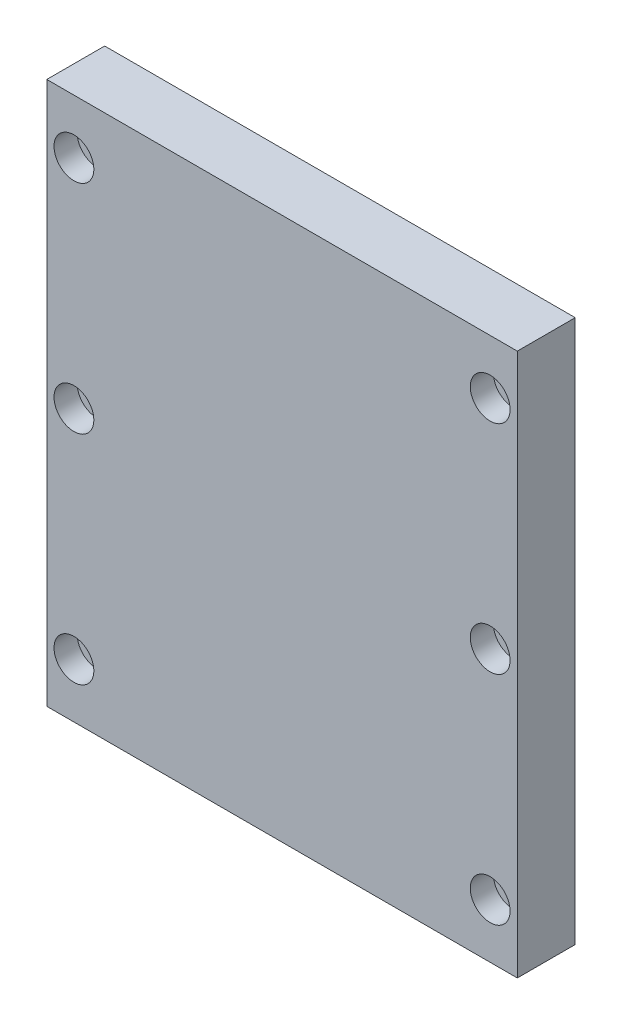
ISO-10303-21;
HEADER;
FILE_DESCRIPTION(('STEP AP214'),'2;1');
FILE_NAME('part.step','',(''),(''),'','','');
FILE_SCHEMA(('AUTOMOTIVE_DESIGN { 1 0 10303 214 1 1 1 1 }'));
ENDSEC;
DATA;
#1=APPLICATION_CONTEXT('core data for automotive mechanical design processes');
#2=APPLICATION_PROTOCOL_DEFINITION('international standard','automotive_design',2000,#1);
#3=PRODUCT_CONTEXT('',#1,'mechanical');
#4=PRODUCT('Part','Part','',(#3));
#5=PRODUCT_RELATED_PRODUCT_CATEGORY('part','',(#4));
#6=PRODUCT_DEFINITION_FORMATION('','',#4);
#7=PRODUCT_DEFINITION_CONTEXT('part definition',#1,'design');
#8=PRODUCT_DEFINITION('design','',#6,#7);
#9=PRODUCT_DEFINITION_SHAPE('','',#8);
#10=(LENGTH_UNIT() NAMED_UNIT(*) SI_UNIT(.MILLI.,.METRE.));
#11=(NAMED_UNIT(*) PLANE_ANGLE_UNIT() SI_UNIT($,.RADIAN.));
#12=(NAMED_UNIT(*) SI_UNIT($,.STERADIAN.) SOLID_ANGLE_UNIT());
#13=UNCERTAINTY_MEASURE_WITH_UNIT(LENGTH_MEASURE(1.E-05),#10,'distance_accuracy_value','');
#14=(GEOMETRIC_REPRESENTATION_CONTEXT(3) GLOBAL_UNCERTAINTY_ASSIGNED_CONTEXT((#13)) GLOBAL_UNIT_ASSIGNED_CONTEXT((#10,
#11,#12)) REPRESENTATION_CONTEXT('',''));
#15=CARTESIAN_POINT('',(0.,0.,0.));
#16=DIRECTION('',(0.,0.,1.));
#17=DIRECTION('',(1.,0.,0.));
#18=AXIS2_PLACEMENT_3D('',#15,#16,#17);
#19=CARTESIAN_POINT('',(65.,75.,16.));
#20=DIRECTION('',(-1.,0.,0.));
#21=DIRECTION('',(0.,-1.,0.));
#22=AXIS2_PLACEMENT_3D('',#19,#20,#21);
#23=PLANE('',#22);
#24=DIRECTION('',(0.,1.,0.));
#25=VECTOR('',#24,1.);
#26=CARTESIAN_POINT('',(65.,75.,0.));
#27=LINE('',#26,#25);
#28=CARTESIAN_POINT('',(65.,-75.,0.));
#29=VERTEX_POINT('',#28);
#30=CARTESIAN_POINT('',(65.,75.,0.));
#31=VERTEX_POINT('',#30);
#32=EDGE_CURVE('E98',#29,#31,#27,.T.);
#33=ORIENTED_EDGE('',*,*,#32,.T.);
#34=DIRECTION('',(0.,0.,-1.));
#35=VECTOR('',#34,1.);
#36=CARTESIAN_POINT('',(65.,75.,16.));
#37=LINE('',#36,#35);
#38=CARTESIAN_POINT('',(65.,75.,16.));
#39=VERTEX_POINT('',#38);
#40=EDGE_CURVE('E11',#39,#31,#37,.T.);
#41=ORIENTED_EDGE('',*,*,#40,.F.);
#42=DIRECTION('',(0.,1.,0.));
#43=VECTOR('',#42,1.);
#44=CARTESIAN_POINT('',(65.,75.,16.));
#45=LINE('',#44,#43);
#46=CARTESIAN_POINT('',(65.,-75.,16.));
#47=VERTEX_POINT('',#46);
#48=EDGE_CURVE('E86',#47,#39,#45,.T.);
#49=ORIENTED_EDGE('',*,*,#48,.F.);
#50=DIRECTION('',(0.,0.,-1.));
#51=VECTOR('',#50,1.);
#52=CARTESIAN_POINT('',(65.,-75.,16.));
#53=LINE('',#52,#51);
#54=EDGE_CURVE('E94',#47,#29,#53,.T.);
#55=ORIENTED_EDGE('',*,*,#54,.T.);
#56=EDGE_LOOP('',(#33,#41,#49,#55));
#57=FACE_BOUND('',#56,.T.);
#58=ADVANCED_FACE('F35',(#57),#23,.F.);
#59=CARTESIAN_POINT('',(-65.,75.,16.));
#60=DIRECTION('',(0.,-1.,0.));
#61=DIRECTION('',(0.,0.,-1.));
#62=AXIS2_PLACEMENT_3D('',#59,#60,#61);
#63=PLANE('',#62);
#64=DIRECTION('',(-1.,0.,0.));
#65=VECTOR('',#64,1.);
#66=CARTESIAN_POINT('',(-65.,75.,0.));
#67=LINE('',#66,#65);
#68=CARTESIAN_POINT('',(-65.,75.,0.));
#69=VERTEX_POINT('',#68);
#70=EDGE_CURVE('E90',#31,#69,#67,.T.);
#71=ORIENTED_EDGE('',*,*,#70,.T.);
#72=DIRECTION('',(0.,0.,-1.));
#73=VECTOR('',#72,1.);
#74=CARTESIAN_POINT('',(-65.,75.,16.));
#75=LINE('',#74,#73);
#76=CARTESIAN_POINT('',(-65.,75.,16.));
#77=VERTEX_POINT('',#76);
#78=EDGE_CURVE('E43',#77,#69,#75,.T.);
#79=ORIENTED_EDGE('',*,*,#78,.F.);
#80=DIRECTION('',(-1.,0.,0.));
#81=VECTOR('',#80,1.);
#82=CARTESIAN_POINT('',(-65.,75.,16.));
#83=LINE('',#82,#81);
#84=EDGE_CURVE('E81',#39,#77,#83,.T.);
#85=ORIENTED_EDGE('',*,*,#84,.F.);
#86=ORIENTED_EDGE('',*,*,#40,.T.);
#87=EDGE_LOOP('',(#71,#79,#85,#86));
#88=FACE_BOUND('',#87,.T.);
#89=ADVANCED_FACE('F89',(#88),#63,.F.);
#90=CARTESIAN_POINT('',(-65.,75.,16.));
#91=DIRECTION('',(1.,0.,0.));
#92=DIRECTION('',(0.,1.,0.));
#93=AXIS2_PLACEMENT_3D('',#90,#91,#92);
#94=PLANE('',#93);
#95=DIRECTION('',(0.,-1.,0.));
#96=VECTOR('',#95,1.);
#97=CARTESIAN_POINT('',(-65.,75.,0.));
#98=LINE('',#97,#96);
#99=CARTESIAN_POINT('',(-65.,-75.,0.));
#100=VERTEX_POINT('',#99);
#101=EDGE_CURVE('E68',#69,#100,#98,.T.);
#102=ORIENTED_EDGE('',*,*,#101,.T.);
#103=DIRECTION('',(0.,0.,-1.));
#104=VECTOR('',#103,1.);
#105=CARTESIAN_POINT('',(-65.,-75.,16.));
#106=LINE('',#105,#104);
#107=CARTESIAN_POINT('',(-65.,-75.,16.));
#108=VERTEX_POINT('',#107);
#109=EDGE_CURVE('E91',#108,#100,#106,.T.);
#110=ORIENTED_EDGE('',*,*,#109,.F.);
#111=DIRECTION('',(0.,-1.,0.));
#112=VECTOR('',#111,1.);
#113=CARTESIAN_POINT('',(-65.,75.,16.));
#114=LINE('',#113,#112);
#115=EDGE_CURVE('E84',#77,#108,#114,.T.);
#116=ORIENTED_EDGE('',*,*,#115,.F.);
#117=ORIENTED_EDGE('',*,*,#78,.T.);
#118=EDGE_LOOP('',(#102,#110,#116,#117));
#119=FACE_BOUND('',#118,.T.);
#120=ADVANCED_FACE('F92',(#119),#94,.F.);
#121=CARTESIAN_POINT('',(-65.,-75.,16.));
#122=DIRECTION('',(0.,1.,0.));
#123=DIRECTION('',(0.,0.,1.));
#124=AXIS2_PLACEMENT_3D('',#121,#122,#123);
#125=PLANE('',#124);
#126=DIRECTION('',(1.,0.,0.));
#127=VECTOR('',#126,1.);
#128=CARTESIAN_POINT('',(-65.,-75.,0.));
#129=LINE('',#128,#127);
#130=EDGE_CURVE('E74',#100,#29,#129,.T.);
#131=ORIENTED_EDGE('',*,*,#130,.T.);
#132=ORIENTED_EDGE('',*,*,#54,.F.);
#133=DIRECTION('',(1.,0.,0.));
#134=VECTOR('',#133,1.);
#135=CARTESIAN_POINT('',(-65.,-75.,16.));
#136=LINE('',#135,#134);
#137=EDGE_CURVE('E51',#108,#47,#136,.T.);
#138=ORIENTED_EDGE('',*,*,#137,.F.);
#139=ORIENTED_EDGE('',*,*,#109,.T.);
#140=EDGE_LOOP('',(#131,#132,#138,#139));
#141=FACE_BOUND('',#140,.T.);
#142=ADVANCED_FACE('F106',(#141),#125,.F.);
#143=CARTESIAN_POINT('',(0.,0.,16.));
#144=DIRECTION('',(0.,0.,1.));
#145=DIRECTION('',(1.,0.,0.));
#146=AXIS2_PLACEMENT_3D('',#143,#144,#145);
#147=PLANE('',#146);
#148=CARTESIAN_POINT('',(-57.5,60.,16.));
#149=DIRECTION('',(0.,0.,1.));
#150=DIRECTION('',(1.,0.,0.));
#151=AXIS2_PLACEMENT_3D('',#148,#149,#150);
#152=CIRCLE('',#151,5.5);
#153=CARTESIAN_POINT('',(-52.,60.,16.));
#154=VERTEX_POINT('',#153);
#155=EDGE_CURVE('E180',#154,#154,#152,.T.);
#156=ORIENTED_EDGE('',*,*,#155,.F.);
#157=EDGE_LOOP('',(#156));
#158=FACE_BOUND('',#157,.T.);
#159=CARTESIAN_POINT('',(-57.5,0.,16.));
#160=DIRECTION('',(0.,0.,1.));
#161=DIRECTION('',(1.,0.,0.));
#162=AXIS2_PLACEMENT_3D('',#159,#160,#161);
#163=CIRCLE('',#162,5.5);
#164=CARTESIAN_POINT('',(-52.,0.,16.));
#165=VERTEX_POINT('',#164);
#166=EDGE_CURVE('E168',#165,#165,#163,.T.);
#167=ORIENTED_EDGE('',*,*,#166,.F.);
#168=EDGE_LOOP('',(#167));
#169=FACE_BOUND('',#168,.T.);
#170=CARTESIAN_POINT('',(-57.5,-60.,16.));
#171=DIRECTION('',(0.,0.,1.));
#172=DIRECTION('',(1.,0.,0.));
#173=AXIS2_PLACEMENT_3D('',#170,#171,#172);
#174=CIRCLE('',#173,5.5);
#175=CARTESIAN_POINT('',(-52.,-60.,16.));
#176=VERTEX_POINT('',#175);
#177=EDGE_CURVE('E156',#176,#176,#174,.T.);
#178=ORIENTED_EDGE('',*,*,#177,.F.);
#179=EDGE_LOOP('',(#178));
#180=FACE_BOUND('',#179,.T.);
#181=CARTESIAN_POINT('',(57.5,-60.,16.));
#182=DIRECTION('',(0.,0.,1.));
#183=DIRECTION('',(1.,0.,0.));
#184=AXIS2_PLACEMENT_3D('',#181,#182,#183);
#185=CIRCLE('',#184,5.5);
#186=CARTESIAN_POINT('',(63.,-60.,16.));
#187=VERTEX_POINT('',#186);
#188=EDGE_CURVE('E144',#187,#187,#185,.T.);
#189=ORIENTED_EDGE('',*,*,#188,.F.);
#190=EDGE_LOOP('',(#189));
#191=FACE_BOUND('',#190,.T.);
#192=CARTESIAN_POINT('',(57.5,0.,16.));
#193=DIRECTION('',(0.,0.,1.));
#194=DIRECTION('',(1.,0.,0.));
#195=AXIS2_PLACEMENT_3D('',#192,#193,#194);
#196=CIRCLE('',#195,5.5);
#197=CARTESIAN_POINT('',(63.,0.,16.));
#198=VERTEX_POINT('',#197);
#199=EDGE_CURVE('E132',#198,#198,#196,.T.);
#200=ORIENTED_EDGE('',*,*,#199,.F.);
#201=EDGE_LOOP('',(#200));
#202=FACE_BOUND('',#201,.T.);
#203=CARTESIAN_POINT('',(57.5,60.,16.));
#204=DIRECTION('',(0.,0.,1.));
#205=DIRECTION('',(1.,0.,0.));
#206=AXIS2_PLACEMENT_3D('',#203,#204,#205);
#207=CIRCLE('',#206,5.5);
#208=CARTESIAN_POINT('',(63.,60.,16.));
#209=VERTEX_POINT('',#208);
#210=EDGE_CURVE('E120',#209,#209,#207,.T.);
#211=ORIENTED_EDGE('',*,*,#210,.F.);
#212=EDGE_LOOP('',(#211));
#213=FACE_BOUND('',#212,.T.);
#214=ORIENTED_EDGE('',*,*,#48,.T.);
#215=ORIENTED_EDGE('',*,*,#84,.T.);
#216=ORIENTED_EDGE('',*,*,#115,.T.);
#217=ORIENTED_EDGE('',*,*,#137,.T.);
#218=EDGE_LOOP('',(#214,#215,#216,#217));
#219=FACE_BOUND('',#218,.T.);
#220=ADVANCED_FACE('F82',(#158,#169,#180,#191,#202,#213,#219),#147,.T.);
#221=CARTESIAN_POINT('',(0.,0.,0.));
#222=DIRECTION('',(0.,0.,1.));
#223=DIRECTION('',(1.,0.,0.));
#224=AXIS2_PLACEMENT_3D('',#221,#222,#223);
#225=PLANE('',#224);
#226=CARTESIAN_POINT('',(-57.5,60.,0.));
#227=DIRECTION('',(0.,0.,1.));
#228=DIRECTION('',(1.,0.,0.));
#229=AXIS2_PLACEMENT_3D('',#226,#227,#228);
#230=CIRCLE('',#229,3.3);
#231=CARTESIAN_POINT('',(-54.2,60.,0.));
#232=VERTEX_POINT('',#231);
#233=EDGE_CURVE('E171',#232,#232,#230,.T.);
#234=ORIENTED_EDGE('',*,*,#233,.T.);
#235=EDGE_LOOP('',(#234));
#236=FACE_BOUND('',#235,.T.);
#237=CARTESIAN_POINT('',(-57.5,0.,0.));
#238=DIRECTION('',(0.,0.,1.));
#239=DIRECTION('',(1.,0.,0.));
#240=AXIS2_PLACEMENT_3D('',#237,#238,#239);
#241=CIRCLE('',#240,3.3);
#242=CARTESIAN_POINT('',(-54.2,0.,0.));
#243=VERTEX_POINT('',#242);
#244=EDGE_CURVE('E159',#243,#243,#241,.T.);
#245=ORIENTED_EDGE('',*,*,#244,.T.);
#246=EDGE_LOOP('',(#245));
#247=FACE_BOUND('',#246,.T.);
#248=CARTESIAN_POINT('',(-57.5,-60.,0.));
#249=DIRECTION('',(0.,0.,1.));
#250=DIRECTION('',(1.,0.,0.));
#251=AXIS2_PLACEMENT_3D('',#248,#249,#250);
#252=CIRCLE('',#251,3.3);
#253=CARTESIAN_POINT('',(-54.2,-60.,0.));
#254=VERTEX_POINT('',#253);
#255=EDGE_CURVE('E147',#254,#254,#252,.T.);
#256=ORIENTED_EDGE('',*,*,#255,.T.);
#257=EDGE_LOOP('',(#256));
#258=FACE_BOUND('',#257,.T.);
#259=CARTESIAN_POINT('',(57.5,-60.,0.));
#260=DIRECTION('',(0.,0.,1.));
#261=DIRECTION('',(1.,0.,0.));
#262=AXIS2_PLACEMENT_3D('',#259,#260,#261);
#263=CIRCLE('',#262,3.3);
#264=CARTESIAN_POINT('',(60.8,-60.,0.));
#265=VERTEX_POINT('',#264);
#266=EDGE_CURVE('E135',#265,#265,#263,.T.);
#267=ORIENTED_EDGE('',*,*,#266,.T.);
#268=EDGE_LOOP('',(#267));
#269=FACE_BOUND('',#268,.T.);
#270=CARTESIAN_POINT('',(57.5,0.,0.));
#271=DIRECTION('',(0.,0.,1.));
#272=DIRECTION('',(1.,0.,0.));
#273=AXIS2_PLACEMENT_3D('',#270,#271,#272);
#274=CIRCLE('',#273,3.3);
#275=CARTESIAN_POINT('',(60.8,0.,0.));
#276=VERTEX_POINT('',#275);
#277=EDGE_CURVE('E123',#276,#276,#274,.T.);
#278=ORIENTED_EDGE('',*,*,#277,.T.);
#279=EDGE_LOOP('',(#278));
#280=FACE_BOUND('',#279,.T.);
#281=CARTESIAN_POINT('',(57.5,60.,0.));
#282=DIRECTION('',(0.,0.,1.));
#283=DIRECTION('',(1.,0.,0.));
#284=AXIS2_PLACEMENT_3D('',#281,#282,#283);
#285=CIRCLE('',#284,3.3);
#286=CARTESIAN_POINT('',(60.8,60.,0.));
#287=VERTEX_POINT('',#286);
#288=EDGE_CURVE('E101',#287,#287,#285,.T.);
#289=ORIENTED_EDGE('',*,*,#288,.T.);
#290=EDGE_LOOP('',(#289));
#291=FACE_BOUND('',#290,.T.);
#292=ORIENTED_EDGE('',*,*,#32,.F.);
#293=ORIENTED_EDGE('',*,*,#130,.F.);
#294=ORIENTED_EDGE('',*,*,#101,.F.);
#295=ORIENTED_EDGE('',*,*,#70,.F.);
#296=EDGE_LOOP('',(#292,#293,#294,#295));
#297=FACE_BOUND('',#296,.T.);
#298=ADVANCED_FACE('F109',(#236,#247,#258,#269,#280,#291,#297),#225,.F.);
#299=CARTESIAN_POINT('',(57.5,60.,16.));
#300=DIRECTION('',(0.,0.,1.));
#301=DIRECTION('',(1.,0.,0.));
#302=AXIS2_PLACEMENT_3D('',#299,#300,#301);
#303=CYLINDRICAL_SURFACE('',#302,3.3);
#304=ORIENTED_EDGE('',*,*,#288,.F.);
#305=EDGE_LOOP('',(#304));
#306=FACE_BOUND('',#305,.T.);
#307=CARTESIAN_POINT('',(57.5,60.,9.6));
#308=DIRECTION('',(0.,0.,1.));
#309=DIRECTION('',(1.,0.,0.));
#310=AXIS2_PLACEMENT_3D('',#307,#308,#309);
#311=CIRCLE('',#310,3.3);
#312=CARTESIAN_POINT('',(60.8,60.,9.6));
#313=VERTEX_POINT('',#312);
#314=EDGE_CURVE('E114',#313,#313,#311,.T.);
#315=ORIENTED_EDGE('',*,*,#314,.T.);
#316=EDGE_LOOP('',(#315));
#317=FACE_BOUND('',#316,.T.);
#318=ADVANCED_FACE('F212',(#306,#317),#303,.F.);
#319=CARTESIAN_POINT('',(60.8,60.,9.6));
#320=DIRECTION('',(0.,0.,-1.));
#321=DIRECTION('',(-1.,0.,0.));
#322=AXIS2_PLACEMENT_3D('',#319,#320,#321);
#323=PLANE('',#322);
#324=ORIENTED_EDGE('',*,*,#314,.F.);
#325=EDGE_LOOP('',(#324));
#326=FACE_BOUND('',#325,.T.);
#327=CARTESIAN_POINT('',(57.5,60.,9.6));
#328=DIRECTION('',(0.,0.,1.));
#329=DIRECTION('',(1.,0.,0.));
#330=AXIS2_PLACEMENT_3D('',#327,#328,#329);
#331=CIRCLE('',#330,5.5);
#332=CARTESIAN_POINT('',(63.,60.,9.6));
#333=VERTEX_POINT('',#332);
#334=EDGE_CURVE('E117',#333,#333,#331,.T.);
#335=ORIENTED_EDGE('',*,*,#334,.T.);
#336=EDGE_LOOP('',(#335));
#337=FACE_BOUND('',#336,.T.);
#338=ADVANCED_FACE('F202',(#326,#337),#323,.F.);
#339=CARTESIAN_POINT('',(57.5,60.,16.));
#340=DIRECTION('',(0.,0.,1.));
#341=DIRECTION('',(1.,0.,0.));
#342=AXIS2_PLACEMENT_3D('',#339,#340,#341);
#343=CYLINDRICAL_SURFACE('',#342,5.5);
#344=ORIENTED_EDGE('',*,*,#334,.F.);
#345=EDGE_LOOP('',(#344));
#346=FACE_BOUND('',#345,.T.);
#347=ORIENTED_EDGE('',*,*,#210,.T.);
#348=EDGE_LOOP('',(#347));
#349=FACE_BOUND('',#348,.T.);
#350=ADVANCED_FACE('F199',(#346,#349),#343,.F.);
#351=CARTESIAN_POINT('',(57.5,0.,16.));
#352=DIRECTION('',(0.,0.,1.));
#353=DIRECTION('',(1.,0.,0.));
#354=AXIS2_PLACEMENT_3D('',#351,#352,#353);
#355=CYLINDRICAL_SURFACE('',#354,3.3);
#356=ORIENTED_EDGE('',*,*,#277,.F.);
#357=EDGE_LOOP('',(#356));
#358=FACE_BOUND('',#357,.T.);
#359=CARTESIAN_POINT('',(57.5,0.,9.6));
#360=DIRECTION('',(0.,0.,1.));
#361=DIRECTION('',(1.,0.,0.));
#362=AXIS2_PLACEMENT_3D('',#359,#360,#361);
#363=CIRCLE('',#362,3.3);
#364=CARTESIAN_POINT('',(60.8,0.,9.6));
#365=VERTEX_POINT('',#364);
#366=EDGE_CURVE('E126',#365,#365,#363,.T.);
#367=ORIENTED_EDGE('',*,*,#366,.T.);
#368=EDGE_LOOP('',(#367));
#369=FACE_BOUND('',#368,.T.);
#370=ADVANCED_FACE('F201',(#358,#369),#355,.F.);
#371=CARTESIAN_POINT('',(60.8,0.,9.6));
#372=DIRECTION('',(0.,0.,-1.));
#373=DIRECTION('',(-1.,0.,0.));
#374=AXIS2_PLACEMENT_3D('',#371,#372,#373);
#375=PLANE('',#374);
#376=ORIENTED_EDGE('',*,*,#366,.F.);
#377=EDGE_LOOP('',(#376));
#378=FACE_BOUND('',#377,.T.);
#379=CARTESIAN_POINT('',(57.5,0.,9.6));
#380=DIRECTION('',(0.,0.,1.));
#381=DIRECTION('',(1.,0.,0.));
#382=AXIS2_PLACEMENT_3D('',#379,#380,#381);
#383=CIRCLE('',#382,5.5);
#384=CARTESIAN_POINT('',(63.,0.,9.6));
#385=VERTEX_POINT('',#384);
#386=EDGE_CURVE('E129',#385,#385,#383,.T.);
#387=ORIENTED_EDGE('',*,*,#386,.T.);
#388=EDGE_LOOP('',(#387));
#389=FACE_BOUND('',#388,.T.);
#390=ADVANCED_FACE('F209',(#378,#389),#375,.F.);
#391=CARTESIAN_POINT('',(57.5,0.,16.));
#392=DIRECTION('',(0.,0.,1.));
#393=DIRECTION('',(1.,0.,0.));
#394=AXIS2_PLACEMENT_3D('',#391,#392,#393);
#395=CYLINDRICAL_SURFACE('',#394,5.5);
#396=ORIENTED_EDGE('',*,*,#386,.F.);
#397=EDGE_LOOP('',(#396));
#398=FACE_BOUND('',#397,.T.);
#399=ORIENTED_EDGE('',*,*,#199,.T.);
#400=EDGE_LOOP('',(#399));
#401=FACE_BOUND('',#400,.T.);
#402=ADVANCED_FACE('F264',(#398,#401),#395,.F.);
#403=CARTESIAN_POINT('',(57.5,-60.,16.));
#404=DIRECTION('',(0.,0.,1.));
#405=DIRECTION('',(1.,0.,0.));
#406=AXIS2_PLACEMENT_3D('',#403,#404,#405);
#407=CYLINDRICAL_SURFACE('',#406,3.3);
#408=ORIENTED_EDGE('',*,*,#266,.F.);
#409=EDGE_LOOP('',(#408));
#410=FACE_BOUND('',#409,.T.);
#411=CARTESIAN_POINT('',(57.5,-60.,9.6));
#412=DIRECTION('',(0.,0.,1.));
#413=DIRECTION('',(1.,0.,0.));
#414=AXIS2_PLACEMENT_3D('',#411,#412,#413);
#415=CIRCLE('',#414,3.3);
#416=CARTESIAN_POINT('',(60.8,-60.,9.6));
#417=VERTEX_POINT('',#416);
#418=EDGE_CURVE('E138',#417,#417,#415,.T.);
#419=ORIENTED_EDGE('',*,*,#418,.T.);
#420=EDGE_LOOP('',(#419));
#421=FACE_BOUND('',#420,.T.);
#422=ADVANCED_FACE('F274',(#410,#421),#407,.F.);
#423=CARTESIAN_POINT('',(60.8,-60.,9.6));
#424=DIRECTION('',(0.,0.,-1.));
#425=DIRECTION('',(-1.,0.,0.));
#426=AXIS2_PLACEMENT_3D('',#423,#424,#425);
#427=PLANE('',#426);
#428=ORIENTED_EDGE('',*,*,#418,.F.);
#429=EDGE_LOOP('',(#428));
#430=FACE_BOUND('',#429,.T.);
#431=CARTESIAN_POINT('',(57.5,-60.,9.6));
#432=DIRECTION('',(0.,0.,1.));
#433=DIRECTION('',(1.,0.,0.));
#434=AXIS2_PLACEMENT_3D('',#431,#432,#433);
#435=CIRCLE('',#434,5.5);
#436=CARTESIAN_POINT('',(63.,-60.,9.6));
#437=VERTEX_POINT('',#436);
#438=EDGE_CURVE('E141',#437,#437,#435,.T.);
#439=ORIENTED_EDGE('',*,*,#438,.T.);
#440=EDGE_LOOP('',(#439));
#441=FACE_BOUND('',#440,.T.);
#442=ADVANCED_FACE('F284',(#430,#441),#427,.F.);
#443=CARTESIAN_POINT('',(57.5,-60.,16.));
#444=DIRECTION('',(0.,0.,1.));
#445=DIRECTION('',(1.,0.,0.));
#446=AXIS2_PLACEMENT_3D('',#443,#444,#445);
#447=CYLINDRICAL_SURFACE('',#446,5.5);
#448=ORIENTED_EDGE('',*,*,#438,.F.);
#449=EDGE_LOOP('',(#448));
#450=FACE_BOUND('',#449,.T.);
#451=ORIENTED_EDGE('',*,*,#188,.T.);
#452=EDGE_LOOP('',(#451));
#453=FACE_BOUND('',#452,.T.);
#454=ADVANCED_FACE('F294',(#450,#453),#447,.F.);
#455=CARTESIAN_POINT('',(-57.5,-60.,16.));
#456=DIRECTION('',(0.,0.,1.));
#457=DIRECTION('',(1.,0.,0.));
#458=AXIS2_PLACEMENT_3D('',#455,#456,#457);
#459=CYLINDRICAL_SURFACE('',#458,3.3);
#460=ORIENTED_EDGE('',*,*,#255,.F.);
#461=EDGE_LOOP('',(#460));
#462=FACE_BOUND('',#461,.T.);
#463=CARTESIAN_POINT('',(-57.5,-60.,9.6));
#464=DIRECTION('',(0.,0.,1.));
#465=DIRECTION('',(1.,0.,0.));
#466=AXIS2_PLACEMENT_3D('',#463,#464,#465);
#467=CIRCLE('',#466,3.3);
#468=CARTESIAN_POINT('',(-54.2,-60.,9.6));
#469=VERTEX_POINT('',#468);
#470=EDGE_CURVE('E150',#469,#469,#467,.T.);
#471=ORIENTED_EDGE('',*,*,#470,.T.);
#472=EDGE_LOOP('',(#471));
#473=FACE_BOUND('',#472,.T.);
#474=ADVANCED_FACE('F304',(#462,#473),#459,.F.);
#475=CARTESIAN_POINT('',(-54.2,-60.,9.6));
#476=DIRECTION('',(0.,0.,-1.));
#477=DIRECTION('',(-1.,0.,0.));
#478=AXIS2_PLACEMENT_3D('',#475,#476,#477);
#479=PLANE('',#478);
#480=ORIENTED_EDGE('',*,*,#470,.F.);
#481=EDGE_LOOP('',(#480));
#482=FACE_BOUND('',#481,.T.);
#483=CARTESIAN_POINT('',(-57.5,-60.,9.6));
#484=DIRECTION('',(0.,0.,1.));
#485=DIRECTION('',(1.,0.,0.));
#486=AXIS2_PLACEMENT_3D('',#483,#484,#485);
#487=CIRCLE('',#486,5.5);
#488=CARTESIAN_POINT('',(-52.,-60.,9.6));
#489=VERTEX_POINT('',#488);
#490=EDGE_CURVE('E153',#489,#489,#487,.T.);
#491=ORIENTED_EDGE('',*,*,#490,.T.);
#492=EDGE_LOOP('',(#491));
#493=FACE_BOUND('',#492,.T.);
#494=ADVANCED_FACE('F314',(#482,#493),#479,.F.);
#495=CARTESIAN_POINT('',(-57.5,-60.,16.));
#496=DIRECTION('',(0.,0.,1.));
#497=DIRECTION('',(1.,0.,0.));
#498=AXIS2_PLACEMENT_3D('',#495,#496,#497);
#499=CYLINDRICAL_SURFACE('',#498,5.5);
#500=ORIENTED_EDGE('',*,*,#490,.F.);
#501=EDGE_LOOP('',(#500));
#502=FACE_BOUND('',#501,.T.);
#503=ORIENTED_EDGE('',*,*,#177,.T.);
#504=EDGE_LOOP('',(#503));
#505=FACE_BOUND('',#504,.T.);
#506=ADVANCED_FACE('F324',(#502,#505),#499,.F.);
#507=CARTESIAN_POINT('',(-57.5,0.,16.));
#508=DIRECTION('',(0.,0.,1.));
#509=DIRECTION('',(1.,0.,0.));
#510=AXIS2_PLACEMENT_3D('',#507,#508,#509);
#511=CYLINDRICAL_SURFACE('',#510,3.3);
#512=ORIENTED_EDGE('',*,*,#244,.F.);
#513=EDGE_LOOP('',(#512));
#514=FACE_BOUND('',#513,.T.);
#515=CARTESIAN_POINT('',(-57.5,0.,9.6));
#516=DIRECTION('',(0.,0.,1.));
#517=DIRECTION('',(1.,0.,0.));
#518=AXIS2_PLACEMENT_3D('',#515,#516,#517);
#519=CIRCLE('',#518,3.3);
#520=CARTESIAN_POINT('',(-54.2,0.,9.6));
#521=VERTEX_POINT('',#520);
#522=EDGE_CURVE('E162',#521,#521,#519,.T.);
#523=ORIENTED_EDGE('',*,*,#522,.T.);
#524=EDGE_LOOP('',(#523));
#525=FACE_BOUND('',#524,.T.);
#526=ADVANCED_FACE('F334',(#514,#525),#511,.F.);
#527=CARTESIAN_POINT('',(-54.2,0.,9.6));
#528=DIRECTION('',(0.,0.,-1.));
#529=DIRECTION('',(-1.,0.,0.));
#530=AXIS2_PLACEMENT_3D('',#527,#528,#529);
#531=PLANE('',#530);
#532=ORIENTED_EDGE('',*,*,#522,.F.);
#533=EDGE_LOOP('',(#532));
#534=FACE_BOUND('',#533,.T.);
#535=CARTESIAN_POINT('',(-57.5,0.,9.6));
#536=DIRECTION('',(0.,0.,1.));
#537=DIRECTION('',(1.,0.,0.));
#538=AXIS2_PLACEMENT_3D('',#535,#536,#537);
#539=CIRCLE('',#538,5.5);
#540=CARTESIAN_POINT('',(-52.,0.,9.6));
#541=VERTEX_POINT('',#540);
#542=EDGE_CURVE('E165',#541,#541,#539,.T.);
#543=ORIENTED_EDGE('',*,*,#542,.T.);
#544=EDGE_LOOP('',(#543));
#545=FACE_BOUND('',#544,.T.);
#546=ADVANCED_FACE('F344',(#534,#545),#531,.F.);
#547=CARTESIAN_POINT('',(-57.5,0.,16.));
#548=DIRECTION('',(0.,0.,1.));
#549=DIRECTION('',(1.,0.,0.));
#550=AXIS2_PLACEMENT_3D('',#547,#548,#549);
#551=CYLINDRICAL_SURFACE('',#550,5.5);
#552=ORIENTED_EDGE('',*,*,#542,.F.);
#553=EDGE_LOOP('',(#552));
#554=FACE_BOUND('',#553,.T.);
#555=ORIENTED_EDGE('',*,*,#166,.T.);
#556=EDGE_LOOP('',(#555));
#557=FACE_BOUND('',#556,.T.);
#558=ADVANCED_FACE('F354',(#554,#557),#551,.F.);
#559=CARTESIAN_POINT('',(-57.5,60.,16.));
#560=DIRECTION('',(0.,0.,1.));
#561=DIRECTION('',(1.,0.,0.));
#562=AXIS2_PLACEMENT_3D('',#559,#560,#561);
#563=CYLINDRICAL_SURFACE('',#562,3.3);
#564=ORIENTED_EDGE('',*,*,#233,.F.);
#565=EDGE_LOOP('',(#564));
#566=FACE_BOUND('',#565,.T.);
#567=CARTESIAN_POINT('',(-57.5,60.,9.6));
#568=DIRECTION('',(0.,0.,1.));
#569=DIRECTION('',(1.,0.,0.));
#570=AXIS2_PLACEMENT_3D('',#567,#568,#569);
#571=CIRCLE('',#570,3.3);
#572=CARTESIAN_POINT('',(-54.2,60.,9.6));
#573=VERTEX_POINT('',#572);
#574=EDGE_CURVE('E174',#573,#573,#571,.T.);
#575=ORIENTED_EDGE('',*,*,#574,.T.);
#576=EDGE_LOOP('',(#575));
#577=FACE_BOUND('',#576,.T.);
#578=ADVANCED_FACE('F364',(#566,#577),#563,.F.);
#579=CARTESIAN_POINT('',(-54.2,60.,9.6));
#580=DIRECTION('',(0.,0.,-1.));
#581=DIRECTION('',(-1.,0.,0.));
#582=AXIS2_PLACEMENT_3D('',#579,#580,#581);
#583=PLANE('',#582);
#584=ORIENTED_EDGE('',*,*,#574,.F.);
#585=EDGE_LOOP('',(#584));
#586=FACE_BOUND('',#585,.T.);
#587=CARTESIAN_POINT('',(-57.5,60.,9.6));
#588=DIRECTION('',(0.,0.,1.));
#589=DIRECTION('',(1.,0.,0.));
#590=AXIS2_PLACEMENT_3D('',#587,#588,#589);
#591=CIRCLE('',#590,5.5);
#592=CARTESIAN_POINT('',(-52.,60.,9.6));
#593=VERTEX_POINT('',#592);
#594=EDGE_CURVE('E177',#593,#593,#591,.T.);
#595=ORIENTED_EDGE('',*,*,#594,.T.);
#596=EDGE_LOOP('',(#595));
#597=FACE_BOUND('',#596,.T.);
#598=ADVANCED_FACE('F374',(#586,#597),#583,.F.);
#599=CARTESIAN_POINT('',(-57.5,60.,16.));
#600=DIRECTION('',(0.,0.,1.));
#601=DIRECTION('',(1.,0.,0.));
#602=AXIS2_PLACEMENT_3D('',#599,#600,#601);
#603=CYLINDRICAL_SURFACE('',#602,5.5);
#604=ORIENTED_EDGE('',*,*,#594,.F.);
#605=EDGE_LOOP('',(#604));
#606=FACE_BOUND('',#605,.T.);
#607=ORIENTED_EDGE('',*,*,#155,.T.);
#608=EDGE_LOOP('',(#607));
#609=FACE_BOUND('',#608,.T.);
#610=ADVANCED_FACE('F184',(#606,#609),#603,.F.);
#611=CLOSED_SHELL('',(#58,#89,#120,#142,#220,#298,#318,#338,#350,#370,#390,#402,#422,#442,#454,
#474,#494,#506,#526,#546,#558,#578,#598,#610));
#612=MANIFOLD_SOLID_BREP('B2',#611);
#613=ADVANCED_BREP_SHAPE_REPRESENTATION('',(#18,#612),#14);
#614=SHAPE_DEFINITION_REPRESENTATION(#9,#613);
ENDSEC;
END-ISO-10303-21;
